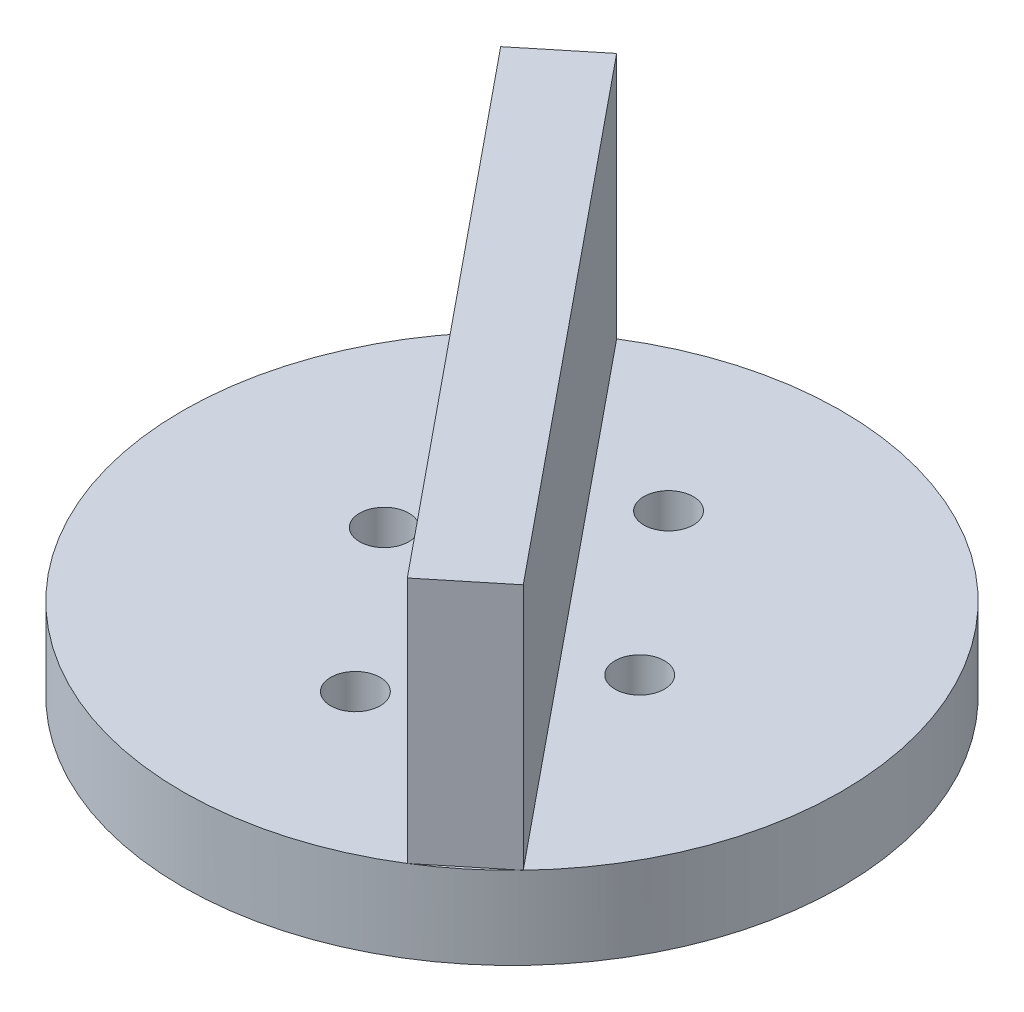
ISO-10303-21;
HEADER;
FILE_DESCRIPTION(('STEP AP214'),'2;1');
FILE_NAME('part.step','',(''),(''),'','','');
FILE_SCHEMA(('AUTOMOTIVE_DESIGN { 1 0 10303 214 1 1 1 1 }'));
ENDSEC;
DATA;
#1=APPLICATION_CONTEXT('core data for automotive mechanical design processes');
#2=APPLICATION_PROTOCOL_DEFINITION('international standard','automotive_design',2000,#1);
#3=PRODUCT_CONTEXT('',#1,'mechanical');
#4=PRODUCT('Part','Part','',(#3));
#5=PRODUCT_RELATED_PRODUCT_CATEGORY('part','',(#4));
#6=PRODUCT_DEFINITION_FORMATION('','',#4);
#7=PRODUCT_DEFINITION_CONTEXT('part definition',#1,'design');
#8=PRODUCT_DEFINITION('design','',#6,#7);
#9=PRODUCT_DEFINITION_SHAPE('','',#8);
#10=(LENGTH_UNIT() NAMED_UNIT(*) SI_UNIT(.MILLI.,.METRE.));
#11=(NAMED_UNIT(*) PLANE_ANGLE_UNIT() SI_UNIT($,.RADIAN.));
#12=(NAMED_UNIT(*) SI_UNIT($,.STERADIAN.) SOLID_ANGLE_UNIT());
#13=UNCERTAINTY_MEASURE_WITH_UNIT(LENGTH_MEASURE(1.E-05),#10,'distance_accuracy_value','');
#14=(GEOMETRIC_REPRESENTATION_CONTEXT(3) GLOBAL_UNCERTAINTY_ASSIGNED_CONTEXT((#13)) GLOBAL_UNIT_ASSIGNED_CONTEXT((#10,
#11,#12)) REPRESENTATION_CONTEXT('',''));
#15=CARTESIAN_POINT('',(0.,0.,0.));
#16=DIRECTION('',(0.,0.,1.));
#17=DIRECTION('',(1.,0.,0.));
#18=AXIS2_PLACEMENT_3D('',#15,#16,#17);
#19=CARTESIAN_POINT('',(0.,5.,0.));
#20=DIRECTION('',(0.,1.,0.));
#21=DIRECTION('',(0.,0.,1.));
#22=AXIS2_PLACEMENT_3D('',#19,#20,#21);
#23=PLANE('',#22);
#24=DIRECTION('',(-0.774865020771876,0.,0.632126727471794));
#25=VECTOR('',#24,1.);
#26=CARTESIAN_POINT('',(-14.4805384366857,5.,-13.7954342658601));
#27=LINE('',#26,#25);
#28=CARTESIAN_POINT('',(-10.6062133328263,5.,-16.9560679032191));
#29=VERTEX_POINT('',#28);
#30=CARTESIAN_POINT('',(-14.4805384366857,5.,-13.7954342658601));
#31=VERTEX_POINT('',#30);
#32=EDGE_CURVE('E66',#29,#31,#27,.T.);
#33=ORIENTED_EDGE('',*,*,#32,.F.);
#34=CARTESIAN_POINT('',(0.,5.,0.));
#35=DIRECTION('',(0.,1.,0.));
#36=DIRECTION('',(0.,0.,1.));
#37=AXIS2_PLACEMENT_3D('',#34,#35,#36);
#38=CIRCLE('',#37,20.);
#39=EDGE_CURVE('E171',#29,#31,#38,.T.);
#40=ORIENTED_EDGE('',*,*,#39,.T.);
#41=EDGE_LOOP('',(#33,#40));
#42=FACE_BOUND('',#41,.T.);
#43=ADVANCED_FACE('F43',(#42),#23,.T.);
#44=DIRECTION('',(-0.632126727471794,0.,-0.774865020771876));
#45=VECTOR('',#44,1.);
#46=CARTESIAN_POINT('',(-10.6062133328263,5.,-16.9560679032191));
#47=LINE('',#46,#45);
#48=CARTESIAN_POINT('',(14.4805384366859,5.,13.79543426586));
#49=VERTEX_POINT('',#48);
#50=EDGE_CURVE('E107',#49,#29,#47,.T.);
#51=ORIENTED_EDGE('',*,*,#50,.F.);
#52=EDGE_CURVE('E52',#49,#29,#38,.T.);
#53=ORIENTED_EDGE('',*,*,#52,.T.);
#54=EDGE_LOOP('',(#51,#53));
#55=FACE_BOUND('',#54,.T.);
#56=CARTESIAN_POINT('',(7.75,5.,0.));
#57=DIRECTION('',(0.,1.,0.));
#58=DIRECTION('',(0.,0.,1.));
#59=AXIS2_PLACEMENT_3D('',#56,#57,#58);
#60=CIRCLE('',#59,1.5);
#61=CARTESIAN_POINT('',(7.75,5.,1.5));
#62=VERTEX_POINT('',#61);
#63=EDGE_CURVE('E113',#62,#62,#60,.T.);
#64=ORIENTED_EDGE('',*,*,#63,.F.);
#65=EDGE_LOOP('',(#64));
#66=FACE_BOUND('',#65,.T.);
#67=CARTESIAN_POINT('',(0.,5.,-9.5));
#68=DIRECTION('',(0.,1.,0.));
#69=DIRECTION('',(0.,0.,1.));
#70=AXIS2_PLACEMENT_3D('',#67,#68,#69);
#71=CIRCLE('',#70,1.5);
#72=CARTESIAN_POINT('',(0.,5.,-8.));
#73=VERTEX_POINT('',#72);
#74=EDGE_CURVE('E119',#73,#73,#71,.T.);
#75=ORIENTED_EDGE('',*,*,#74,.F.);
#76=EDGE_LOOP('',(#75));
#77=FACE_BOUND('',#76,.T.);
#78=ADVANCED_FACE('F143',(#55,#66,#77),#23,.T.);
#79=DIRECTION('',(0.774865020771876,0.,-0.632126727471794));
#80=VECTOR('',#79,1.);
#81=CARTESIAN_POINT('',(10.6062133328263,5.,16.9560679032191));
#82=LINE('',#81,#80);
#83=CARTESIAN_POINT('',(10.6062133328263,5.,16.9560679032191));
#84=VERTEX_POINT('',#83);
#85=EDGE_CURVE('E182',#84,#49,#82,.T.);
#86=ORIENTED_EDGE('',*,*,#85,.F.);
#87=EDGE_CURVE('E11',#84,#49,#38,.T.);
#88=ORIENTED_EDGE('',*,*,#87,.T.);
#89=EDGE_LOOP('',(#86,#88));
#90=FACE_BOUND('',#89,.T.);
#91=ADVANCED_FACE('F146',(#90),#23,.T.);
#92=CARTESIAN_POINT('',(0.,5.,0.));
#93=DIRECTION('',(0.,-1.,0.));
#94=DIRECTION('',(0.,0.,-1.));
#95=AXIS2_PLACEMENT_3D('',#92,#93,#94);
#96=CYLINDRICAL_SURFACE('',#95,20.);
#97=ORIENTED_EDGE('',*,*,#87,.F.);
#98=EDGE_CURVE('E53',#31,#84,#38,.T.);
#99=ORIENTED_EDGE('',*,*,#98,.F.);
#100=ORIENTED_EDGE('',*,*,#39,.F.);
#101=ORIENTED_EDGE('',*,*,#52,.F.);
#102=EDGE_LOOP('',(#97,#99,#100,#101));
#103=FACE_BOUND('',#102,.T.);
#104=CARTESIAN_POINT('',(0.,0.,0.));
#105=DIRECTION('',(0.,1.,0.));
#106=DIRECTION('',(0.,0.,1.));
#107=AXIS2_PLACEMENT_3D('',#104,#105,#106);
#108=CIRCLE('',#107,20.);
#109=CARTESIAN_POINT('',(0.,0.,20.));
#110=VERTEX_POINT('',#109);
#111=EDGE_CURVE('E47',#110,#110,#108,.T.);
#112=ORIENTED_EDGE('',*,*,#111,.T.);
#113=EDGE_LOOP('',(#112));
#114=FACE_BOUND('',#113,.T.);
#115=ADVANCED_FACE('F45',(#103,#114),#96,.T.);
#116=DIRECTION('',(0.632126727471794,0.,0.774865020771876));
#117=VECTOR('',#116,1.);
#118=CARTESIAN_POINT('',(-14.4805384366857,5.,-13.7954342658601));
#119=LINE('',#118,#117);
#120=EDGE_CURVE('E59',#31,#84,#119,.T.);
#121=ORIENTED_EDGE('',*,*,#120,.F.);
#122=ORIENTED_EDGE('',*,*,#98,.T.);
#123=EDGE_LOOP('',(#121,#122));
#124=FACE_BOUND('',#123,.T.);
#125=CARTESIAN_POINT('',(0.,5.,9.5));
#126=DIRECTION('',(0.,1.,0.));
#127=DIRECTION('',(0.,0.,1.));
#128=AXIS2_PLACEMENT_3D('',#125,#126,#127);
#129=CIRCLE('',#128,1.5);
#130=CARTESIAN_POINT('',(0.,5.,11.));
#131=VERTEX_POINT('',#130);
#132=EDGE_CURVE('E123',#131,#131,#129,.T.);
#133=ORIENTED_EDGE('',*,*,#132,.F.);
#134=EDGE_LOOP('',(#133));
#135=FACE_BOUND('',#134,.T.);
#136=CARTESIAN_POINT('',(-7.75,5.,0.));
#137=DIRECTION('',(0.,1.,0.));
#138=DIRECTION('',(0.,0.,1.));
#139=AXIS2_PLACEMENT_3D('',#136,#137,#138);
#140=CIRCLE('',#139,1.5);
#141=CARTESIAN_POINT('',(-7.75,5.,1.5));
#142=VERTEX_POINT('',#141);
#143=EDGE_CURVE('E129',#142,#142,#140,.T.);
#144=ORIENTED_EDGE('',*,*,#143,.F.);
#145=EDGE_LOOP('',(#144));
#146=FACE_BOUND('',#145,.T.);
#147=ADVANCED_FACE('F161',(#124,#135,#146),#23,.T.);
#148=CARTESIAN_POINT('',(0.,0.,0.));
#149=DIRECTION('',(0.,1.,0.));
#150=DIRECTION('',(0.,0.,1.));
#151=AXIS2_PLACEMENT_3D('',#148,#149,#150);
#152=PLANE('',#151);
#153=CARTESIAN_POINT('',(0.,0.,-9.5));
#154=DIRECTION('',(0.,1.,0.));
#155=DIRECTION('',(0.,0.,1.));
#156=AXIS2_PLACEMENT_3D('',#153,#154,#155);
#157=CIRCLE('',#156,1.5);
#158=CARTESIAN_POINT('',(0.,0.,-8.));
#159=VERTEX_POINT('',#158);
#160=EDGE_CURVE('E122',#159,#159,#157,.F.);
#161=ORIENTED_EDGE('',*,*,#160,.F.);
#162=EDGE_LOOP('',(#161));
#163=FACE_BOUND('',#162,.T.);
#164=CARTESIAN_POINT('',(0.,0.,9.5));
#165=DIRECTION('',(0.,1.,0.));
#166=DIRECTION('',(0.,0.,1.));
#167=AXIS2_PLACEMENT_3D('',#164,#165,#166);
#168=CIRCLE('',#167,1.5);
#169=CARTESIAN_POINT('',(0.,0.,11.));
#170=VERTEX_POINT('',#169);
#171=EDGE_CURVE('E126',#170,#170,#168,.F.);
#172=ORIENTED_EDGE('',*,*,#171,.F.);
#173=EDGE_LOOP('',(#172));
#174=FACE_BOUND('',#173,.T.);
#175=CARTESIAN_POINT('',(-7.75,0.,0.));
#176=DIRECTION('',(0.,1.,0.));
#177=DIRECTION('',(0.,0.,1.));
#178=AXIS2_PLACEMENT_3D('',#175,#176,#177);
#179=CIRCLE('',#178,1.5);
#180=CARTESIAN_POINT('',(-7.75,0.,1.5));
#181=VERTEX_POINT('',#180);
#182=EDGE_CURVE('E132',#181,#181,#179,.F.);
#183=ORIENTED_EDGE('',*,*,#182,.F.);
#184=EDGE_LOOP('',(#183));
#185=FACE_BOUND('',#184,.T.);
#186=CARTESIAN_POINT('',(7.75,0.,0.));
#187=DIRECTION('',(0.,1.,0.));
#188=DIRECTION('',(0.,0.,1.));
#189=AXIS2_PLACEMENT_3D('',#186,#187,#188);
#190=CIRCLE('',#189,1.5);
#191=CARTESIAN_POINT('',(7.75,0.,1.5));
#192=VERTEX_POINT('',#191);
#193=EDGE_CURVE('E110',#192,#192,#190,.F.);
#194=ORIENTED_EDGE('',*,*,#193,.F.);
#195=EDGE_LOOP('',(#194));
#196=FACE_BOUND('',#195,.T.);
#197=ORIENTED_EDGE('',*,*,#111,.F.);
#198=EDGE_LOOP('',(#197));
#199=FACE_BOUND('',#198,.T.);
#200=ADVANCED_FACE('F158',(#163,#174,#185,#196,#199),#152,.F.);
#201=CARTESIAN_POINT('',(7.75,-0.00100000000000013,0.));
#202=DIRECTION('',(0.,1.,0.));
#203=DIRECTION('',(0.,0.,1.));
#204=AXIS2_PLACEMENT_3D('',#201,#202,#203);
#205=CYLINDRICAL_SURFACE('',#204,1.5);
#206=ORIENTED_EDGE('',*,*,#63,.T.);
#207=EDGE_LOOP('',(#206));
#208=FACE_BOUND('',#207,.T.);
#209=ORIENTED_EDGE('',*,*,#193,.T.);
#210=EDGE_LOOP('',(#209));
#211=FACE_BOUND('',#210,.T.);
#212=ADVANCED_FACE('F140',(#208,#211),#205,.F.);
#213=CARTESIAN_POINT('',(-7.75,-0.00100000000000013,0.));
#214=DIRECTION('',(0.,1.,0.));
#215=DIRECTION('',(0.,0.,1.));
#216=AXIS2_PLACEMENT_3D('',#213,#214,#215);
#217=CYLINDRICAL_SURFACE('',#216,1.5);
#218=ORIENTED_EDGE('',*,*,#143,.T.);
#219=EDGE_LOOP('',(#218));
#220=FACE_BOUND('',#219,.T.);
#221=ORIENTED_EDGE('',*,*,#182,.T.);
#222=EDGE_LOOP('',(#221));
#223=FACE_BOUND('',#222,.T.);
#224=ADVANCED_FACE('F205',(#220,#223),#217,.F.);
#225=CARTESIAN_POINT('',(0.,-0.00100000000000013,9.5));
#226=DIRECTION('',(0.,1.,0.));
#227=DIRECTION('',(0.,0.,1.));
#228=AXIS2_PLACEMENT_3D('',#225,#226,#227);
#229=CYLINDRICAL_SURFACE('',#228,1.5);
#230=ORIENTED_EDGE('',*,*,#132,.T.);
#231=EDGE_LOOP('',(#230));
#232=FACE_BOUND('',#231,.T.);
#233=ORIENTED_EDGE('',*,*,#171,.T.);
#234=EDGE_LOOP('',(#233));
#235=FACE_BOUND('',#234,.T.);
#236=ADVANCED_FACE('F154',(#232,#235),#229,.F.);
#237=CARTESIAN_POINT('',(0.,-0.00100000000000013,-9.5));
#238=DIRECTION('',(0.,1.,0.));
#239=DIRECTION('',(0.,0.,1.));
#240=AXIS2_PLACEMENT_3D('',#237,#238,#239);
#241=CYLINDRICAL_SURFACE('',#240,1.5);
#242=ORIENTED_EDGE('',*,*,#74,.T.);
#243=EDGE_LOOP('',(#242));
#244=FACE_BOUND('',#243,.T.);
#245=ORIENTED_EDGE('',*,*,#160,.T.);
#246=EDGE_LOOP('',(#245));
#247=FACE_BOUND('',#246,.T.);
#248=ADVANCED_FACE('F151',(#244,#247),#241,.F.);
#249=CARTESIAN_POINT('',(-14.4805384366857,20.,-13.7954342658601));
#250=DIRECTION('',(0.632126727471794,0.,0.774865020771876));
#251=DIRECTION('',(0.774865020771876,0.,-0.632126727471794));
#252=AXIS2_PLACEMENT_3D('',#249,#250,#251);
#253=PLANE('',#252);
#254=ORIENTED_EDGE('',*,*,#32,.T.);
#255=DIRECTION('',(0.,-1.,0.));
#256=VECTOR('',#255,1.);
#257=CARTESIAN_POINT('',(-14.4805384366857,20.,-13.7954342658601));
#258=LINE('',#257,#256);
#259=CARTESIAN_POINT('',(-14.4805384366857,20.,-13.7954342658601));
#260=VERTEX_POINT('',#259);
#261=EDGE_CURVE('E92',#260,#31,#258,.T.);
#262=ORIENTED_EDGE('',*,*,#261,.F.);
#263=DIRECTION('',(-0.774865020771876,0.,0.632126727471794));
#264=VECTOR('',#263,1.);
#265=CARTESIAN_POINT('',(-14.4805384366857,20.,-13.7954342658601));
#266=LINE('',#265,#264);
#267=CARTESIAN_POINT('',(-10.6062133328263,20.,-16.9560679032191));
#268=VERTEX_POINT('',#267);
#269=EDGE_CURVE('E98',#268,#260,#266,.T.);
#270=ORIENTED_EDGE('',*,*,#269,.F.);
#271=DIRECTION('',(0.,-1.,0.));
#272=VECTOR('',#271,1.);
#273=CARTESIAN_POINT('',(-10.6062133328263,20.,-16.9560679032191));
#274=LINE('',#273,#272);
#275=EDGE_CURVE('E180',#268,#29,#274,.T.);
#276=ORIENTED_EDGE('',*,*,#275,.T.);
#277=EDGE_LOOP('',(#254,#262,#270,#276));
#278=FACE_BOUND('',#277,.T.);
#279=ADVANCED_FACE('F109',(#278),#253,.F.);
#280=CARTESIAN_POINT('',(-14.4805384366857,20.,-13.7954342658601));
#281=DIRECTION('',(0.774865020771876,0.,-0.632126727471794));
#282=DIRECTION('',(-0.632126727471794,0.,-0.774865020771876));
#283=AXIS2_PLACEMENT_3D('',#280,#281,#282);
#284=PLANE('',#283);
#285=ORIENTED_EDGE('',*,*,#120,.T.);
#286=DIRECTION('',(0.,-1.,0.));
#287=VECTOR('',#286,1.);
#288=CARTESIAN_POINT('',(10.6062133328263,20.,16.9560679032191));
#289=LINE('',#288,#287);
#290=CARTESIAN_POINT('',(10.6062133328263,20.,16.9560679032191));
#291=VERTEX_POINT('',#290);
#292=EDGE_CURVE('E94',#291,#84,#289,.T.);
#293=ORIENTED_EDGE('',*,*,#292,.F.);
#294=DIRECTION('',(0.632126727471794,0.,0.774865020771876));
#295=VECTOR('',#294,1.);
#296=CARTESIAN_POINT('',(-14.4805384366857,20.,-13.7954342658601));
#297=LINE('',#296,#295);
#298=EDGE_CURVE('E88',#260,#291,#297,.T.);
#299=ORIENTED_EDGE('',*,*,#298,.F.);
#300=ORIENTED_EDGE('',*,*,#261,.T.);
#301=EDGE_LOOP('',(#285,#293,#299,#300));
#302=FACE_BOUND('',#301,.T.);
#303=ADVANCED_FACE('F90',(#302),#284,.F.);
#304=CARTESIAN_POINT('',(10.6062133328263,20.,16.9560679032191));
#305=DIRECTION('',(-0.632126727471794,0.,-0.774865020771876));
#306=DIRECTION('',(-0.774865020771876,0.,0.632126727471794));
#307=AXIS2_PLACEMENT_3D('',#304,#305,#306);
#308=PLANE('',#307);
#309=ORIENTED_EDGE('',*,*,#85,.T.);
#310=DIRECTION('',(0.,-1.,0.));
#311=VECTOR('',#310,1.);
#312=CARTESIAN_POINT('',(14.4805384366857,20.,13.7954342658601));
#313=LINE('',#312,#311);
#314=CARTESIAN_POINT('',(14.4805384366857,20.,13.7954342658601));
#315=VERTEX_POINT('',#314);
#316=EDGE_CURVE('E115',#315,#49,#313,.T.);
#317=ORIENTED_EDGE('',*,*,#316,.F.);
#318=DIRECTION('',(0.774865020771876,0.,-0.632126727471794));
#319=VECTOR('',#318,1.);
#320=CARTESIAN_POINT('',(10.6062133328263,20.,16.9560679032191));
#321=LINE('',#320,#319);
#322=EDGE_CURVE('E97',#291,#315,#321,.T.);
#323=ORIENTED_EDGE('',*,*,#322,.F.);
#324=ORIENTED_EDGE('',*,*,#292,.T.);
#325=EDGE_LOOP('',(#309,#317,#323,#324));
#326=FACE_BOUND('',#325,.T.);
#327=ADVANCED_FACE('F192',(#326),#308,.F.);
#328=CARTESIAN_POINT('',(-10.6062133328263,20.,-16.9560679032191));
#329=DIRECTION('',(-0.774865020771876,0.,0.632126727471794));
#330=DIRECTION('',(0.632126727471794,0.,0.774865020771876));
#331=AXIS2_PLACEMENT_3D('',#328,#329,#330);
#332=PLANE('',#331);
#333=ORIENTED_EDGE('',*,*,#50,.T.);
#334=ORIENTED_EDGE('',*,*,#275,.F.);
#335=DIRECTION('',(-0.632126727471794,0.,-0.774865020771876));
#336=VECTOR('',#335,1.);
#337=CARTESIAN_POINT('',(-10.6062133328263,20.,-16.9560679032191));
#338=LINE('',#337,#336);
#339=EDGE_CURVE('E103',#315,#268,#338,.T.);
#340=ORIENTED_EDGE('',*,*,#339,.F.);
#341=ORIENTED_EDGE('',*,*,#316,.T.);
#342=EDGE_LOOP('',(#333,#334,#340,#341));
#343=FACE_BOUND('',#342,.T.);
#344=ADVANCED_FACE('F179',(#343),#332,.F.);
#345=CARTESIAN_POINT('',(0.,20.,0.));
#346=DIRECTION('',(0.,-1.,0.));
#347=DIRECTION('',(0.,0.,-1.));
#348=AXIS2_PLACEMENT_3D('',#345,#346,#347);
#349=PLANE('',#348);
#350=ORIENTED_EDGE('',*,*,#269,.T.);
#351=ORIENTED_EDGE('',*,*,#298,.T.);
#352=ORIENTED_EDGE('',*,*,#322,.T.);
#353=ORIENTED_EDGE('',*,*,#339,.T.);
#354=EDGE_LOOP('',(#350,#351,#352,#353));
#355=FACE_BOUND('',#354,.T.);
#356=ADVANCED_FACE('F101',(#355),#349,.F.);
#357=CLOSED_SHELL('',(#43,#78,#91,#115,#147,#200,#212,#224,#236,#248,#279,#303,#327,#344,#356));
#358=MANIFOLD_SOLID_BREP('B2',#357);
#359=ADVANCED_BREP_SHAPE_REPRESENTATION('',(#18,#358),#14);
#360=SHAPE_DEFINITION_REPRESENTATION(#9,#359);
ENDSEC;
END-ISO-10303-21;
